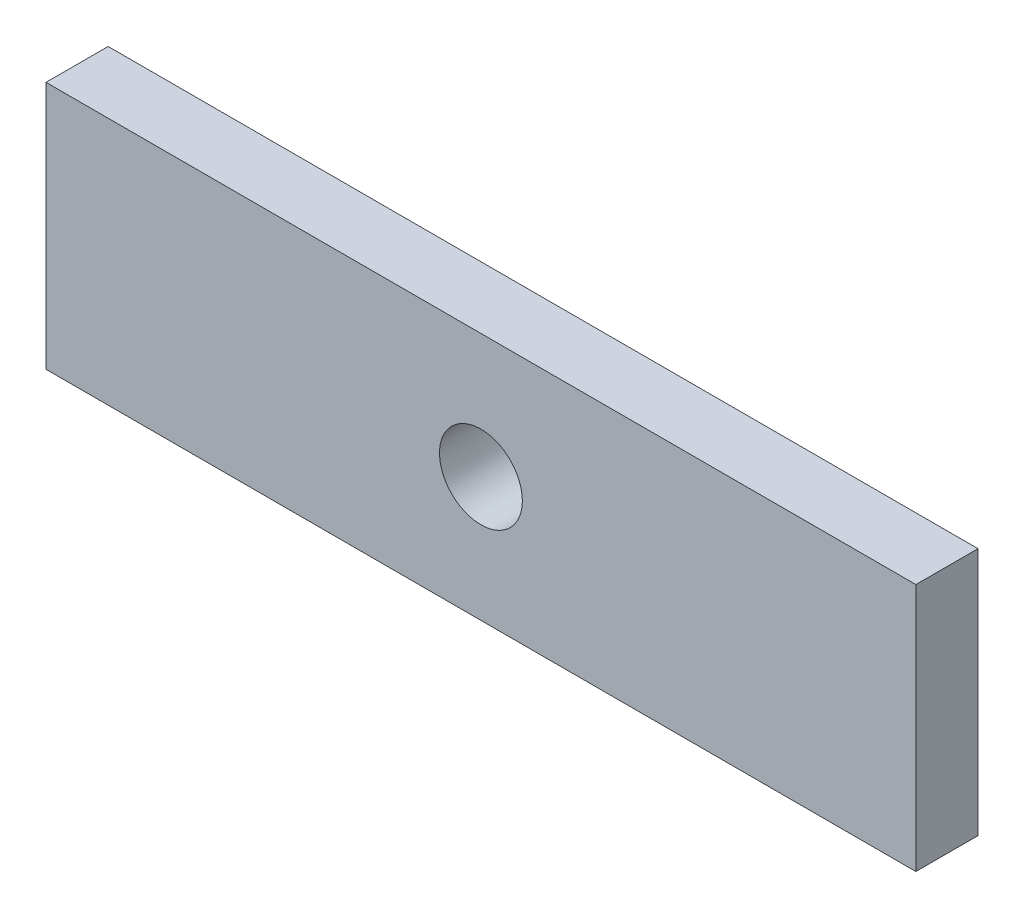
ISO-10303-21;
HEADER;
FILE_DESCRIPTION(('STEP AP214'),'2;1');
FILE_NAME('part.step','',(''),(''),'','','');
FILE_SCHEMA(('AUTOMOTIVE_DESIGN { 1 0 10303 214 1 1 1 1 }'));
ENDSEC;
DATA;
#1=APPLICATION_CONTEXT('core data for automotive mechanical design processes');
#2=APPLICATION_PROTOCOL_DEFINITION('international standard','automotive_design',2000,#1);
#3=PRODUCT_CONTEXT('',#1,'mechanical');
#4=PRODUCT('Part','Part','',(#3));
#5=PRODUCT_RELATED_PRODUCT_CATEGORY('part','',(#4));
#6=PRODUCT_DEFINITION_FORMATION('','',#4);
#7=PRODUCT_DEFINITION_CONTEXT('part definition',#1,'design');
#8=PRODUCT_DEFINITION('design','',#6,#7);
#9=PRODUCT_DEFINITION_SHAPE('','',#8);
#10=(LENGTH_UNIT() NAMED_UNIT(*) SI_UNIT(.MILLI.,.METRE.));
#11=(NAMED_UNIT(*) PLANE_ANGLE_UNIT() SI_UNIT($,.RADIAN.));
#12=(NAMED_UNIT(*) SI_UNIT($,.STERADIAN.) SOLID_ANGLE_UNIT());
#13=UNCERTAINTY_MEASURE_WITH_UNIT(LENGTH_MEASURE(1.E-05),#10,'distance_accuracy_value','');
#14=(GEOMETRIC_REPRESENTATION_CONTEXT(3) GLOBAL_UNCERTAINTY_ASSIGNED_CONTEXT((#13)) GLOBAL_UNIT_ASSIGNED_CONTEXT((#10,
#11,#12)) REPRESENTATION_CONTEXT('',''));
#15=CARTESIAN_POINT('',(0.,0.,0.));
#16=DIRECTION('',(0.,0.,1.));
#17=DIRECTION('',(1.,0.,0.));
#18=AXIS2_PLACEMENT_3D('',#15,#16,#17);
#19=CARTESIAN_POINT('',(0.,120.,30.));
#20=DIRECTION('',(0.,0.,-1.));
#21=DIRECTION('',(-1.,0.,0.));
#22=AXIS2_PLACEMENT_3D('',#19,#20,#21);
#23=PLANE('',#22);
#24=DIRECTION('',(0.,-1.,0.));
#25=VECTOR('',#24,1.);
#26=CARTESIAN_POINT('',(0.,0.,30.));
#27=LINE('',#26,#25);
#28=CARTESIAN_POINT('',(0.,120.,30.));
#29=VERTEX_POINT('',#28);
#30=CARTESIAN_POINT('',(0.,0.,30.));
#31=VERTEX_POINT('',#30);
#32=EDGE_CURVE('E86',#29,#31,#27,.T.);
#33=ORIENTED_EDGE('',*,*,#32,.T.);
#34=DIRECTION('',(1.,0.,0.));
#35=VECTOR('',#34,1.);
#36=CARTESIAN_POINT('',(0.,0.,30.));
#37=LINE('',#36,#35);
#38=CARTESIAN_POINT('',(420.,0.,30.));
#39=VERTEX_POINT('',#38);
#40=EDGE_CURVE('E81',#31,#39,#37,.T.);
#41=ORIENTED_EDGE('',*,*,#40,.T.);
#42=DIRECTION('',(0.,1.,0.));
#43=VECTOR('',#42,1.);
#44=CARTESIAN_POINT('',(420.,0.,30.));
#45=LINE('',#44,#43);
#46=CARTESIAN_POINT('',(420.,120.,30.));
#47=VERTEX_POINT('',#46);
#48=EDGE_CURVE('E84',#39,#47,#45,.T.);
#49=ORIENTED_EDGE('',*,*,#48,.T.);
#50=DIRECTION('',(-1.,0.,0.));
#51=VECTOR('',#50,1.);
#52=CARTESIAN_POINT('',(0.,120.,30.));
#53=LINE('',#52,#51);
#54=EDGE_CURVE('E51',#47,#29,#53,.T.);
#55=ORIENTED_EDGE('',*,*,#54,.T.);
#56=EDGE_LOOP('',(#33,#41,#49,#55));
#57=FACE_BOUND('',#56,.T.);
#58=CARTESIAN_POINT('',(210.,60.,30.));
#59=DIRECTION('',(0.,0.,1.));
#60=DIRECTION('',(1.,0.,0.));
#61=AXIS2_PLACEMENT_3D('',#58,#59,#60);
#62=CIRCLE('',#61,20.);
#63=CARTESIAN_POINT('',(230.,60.,30.));
#64=VERTEX_POINT('',#63);
#65=EDGE_CURVE('E101',#64,#64,#62,.T.);
#66=ORIENTED_EDGE('',*,*,#65,.F.);
#67=EDGE_LOOP('',(#66));
#68=FACE_BOUND('',#67,.T.);
#69=ADVANCED_FACE('F34',(#57,#68),#23,.F.);
#70=CARTESIAN_POINT('',(0.,120.,0.));
#71=DIRECTION('',(0.,0.,-1.));
#72=DIRECTION('',(-1.,0.,0.));
#73=AXIS2_PLACEMENT_3D('',#70,#71,#72);
#74=PLANE('',#73);
#75=DIRECTION('',(0.,-1.,0.));
#76=VECTOR('',#75,1.);
#77=CARTESIAN_POINT('',(0.,0.,0.));
#78=LINE('',#77,#76);
#79=CARTESIAN_POINT('',(0.,120.,0.));
#80=VERTEX_POINT('',#79);
#81=CARTESIAN_POINT('',(0.,0.,0.));
#82=VERTEX_POINT('',#81);
#83=EDGE_CURVE('E98',#80,#82,#78,.T.);
#84=ORIENTED_EDGE('',*,*,#83,.F.);
#85=DIRECTION('',(-1.,0.,0.));
#86=VECTOR('',#85,1.);
#87=CARTESIAN_POINT('',(0.,120.,0.));
#88=LINE('',#87,#86);
#89=CARTESIAN_POINT('',(420.,120.,0.));
#90=VERTEX_POINT('',#89);
#91=EDGE_CURVE('E74',#90,#80,#88,.T.);
#92=ORIENTED_EDGE('',*,*,#91,.F.);
#93=DIRECTION('',(0.,1.,0.));
#94=VECTOR('',#93,1.);
#95=CARTESIAN_POINT('',(420.,0.,0.));
#96=LINE('',#95,#94);
#97=CARTESIAN_POINT('',(420.,0.,0.));
#98=VERTEX_POINT('',#97);
#99=EDGE_CURVE('E68',#98,#90,#96,.T.);
#100=ORIENTED_EDGE('',*,*,#99,.F.);
#101=DIRECTION('',(1.,0.,0.));
#102=VECTOR('',#101,1.);
#103=CARTESIAN_POINT('',(0.,0.,0.));
#104=LINE('',#103,#102);
#105=EDGE_CURVE('E90',#82,#98,#104,.T.);
#106=ORIENTED_EDGE('',*,*,#105,.F.);
#107=EDGE_LOOP('',(#84,#92,#100,#106));
#108=FACE_BOUND('',#107,.T.);
#109=CARTESIAN_POINT('',(210.,60.,0.));
#110=DIRECTION('',(0.,0.,1.));
#111=DIRECTION('',(1.,0.,0.));
#112=AXIS2_PLACEMENT_3D('',#109,#110,#111);
#113=CIRCLE('',#112,20.);
#114=CARTESIAN_POINT('',(230.,60.,0.));
#115=VERTEX_POINT('',#114);
#116=EDGE_CURVE('E113',#115,#115,#113,.T.);
#117=ORIENTED_EDGE('',*,*,#116,.T.);
#118=EDGE_LOOP('',(#117));
#119=FACE_BOUND('',#118,.T.);
#120=ADVANCED_FACE('F109',(#108,#119),#74,.T.);
#121=CARTESIAN_POINT('',(0.,0.,30.));
#122=DIRECTION('',(1.,0.,0.));
#123=DIRECTION('',(0.,0.,-1.));
#124=AXIS2_PLACEMENT_3D('',#121,#122,#123);
#125=PLANE('',#124);
#126=ORIENTED_EDGE('',*,*,#83,.T.);
#127=DIRECTION('',(0.,0.,-1.));
#128=VECTOR('',#127,1.);
#129=CARTESIAN_POINT('',(0.,0.,30.));
#130=LINE('',#129,#128);
#131=EDGE_CURVE('E11',#31,#82,#130,.T.);
#132=ORIENTED_EDGE('',*,*,#131,.F.);
#133=ORIENTED_EDGE('',*,*,#32,.F.);
#134=DIRECTION('',(0.,0.,-1.));
#135=VECTOR('',#134,1.);
#136=CARTESIAN_POINT('',(0.,120.,30.));
#137=LINE('',#136,#135);
#138=EDGE_CURVE('E94',#29,#80,#137,.T.);
#139=ORIENTED_EDGE('',*,*,#138,.T.);
#140=EDGE_LOOP('',(#126,#132,#133,#139));
#141=FACE_BOUND('',#140,.T.);
#142=ADVANCED_FACE('F36',(#141),#125,.F.);
#143=CARTESIAN_POINT('',(0.,0.,30.));
#144=DIRECTION('',(0.,1.,0.));
#145=DIRECTION('',(0.,0.,1.));
#146=AXIS2_PLACEMENT_3D('',#143,#144,#145);
#147=PLANE('',#146);
#148=ORIENTED_EDGE('',*,*,#105,.T.);
#149=DIRECTION('',(0.,0.,-1.));
#150=VECTOR('',#149,1.);
#151=CARTESIAN_POINT('',(420.,0.,30.));
#152=LINE('',#151,#150);
#153=EDGE_CURVE('E43',#39,#98,#152,.T.);
#154=ORIENTED_EDGE('',*,*,#153,.F.);
#155=ORIENTED_EDGE('',*,*,#40,.F.);
#156=ORIENTED_EDGE('',*,*,#131,.T.);
#157=EDGE_LOOP('',(#148,#154,#155,#156));
#158=FACE_BOUND('',#157,.T.);
#159=ADVANCED_FACE('F89',(#158),#147,.F.);
#160=CARTESIAN_POINT('',(420.,0.,30.));
#161=DIRECTION('',(-1.,0.,0.));
#162=DIRECTION('',(0.,-1.,0.));
#163=AXIS2_PLACEMENT_3D('',#160,#161,#162);
#164=PLANE('',#163);
#165=ORIENTED_EDGE('',*,*,#99,.T.);
#166=DIRECTION('',(0.,0.,-1.));
#167=VECTOR('',#166,1.);
#168=CARTESIAN_POINT('',(420.,120.,30.));
#169=LINE('',#168,#167);
#170=EDGE_CURVE('E91',#47,#90,#169,.T.);
#171=ORIENTED_EDGE('',*,*,#170,.F.);
#172=ORIENTED_EDGE('',*,*,#48,.F.);
#173=ORIENTED_EDGE('',*,*,#153,.T.);
#174=EDGE_LOOP('',(#165,#171,#172,#173));
#175=FACE_BOUND('',#174,.T.);
#176=ADVANCED_FACE('F92',(#175),#164,.F.);
#177=CARTESIAN_POINT('',(0.,120.,30.));
#178=DIRECTION('',(0.,-1.,0.));
#179=DIRECTION('',(0.,0.,-1.));
#180=AXIS2_PLACEMENT_3D('',#177,#178,#179);
#181=PLANE('',#180);
#182=ORIENTED_EDGE('',*,*,#91,.T.);
#183=ORIENTED_EDGE('',*,*,#138,.F.);
#184=ORIENTED_EDGE('',*,*,#54,.F.);
#185=ORIENTED_EDGE('',*,*,#170,.T.);
#186=EDGE_LOOP('',(#182,#183,#184,#185));
#187=FACE_BOUND('',#186,.T.);
#188=ADVANCED_FACE('F106',(#187),#181,.F.);
#189=CARTESIAN_POINT('',(210.,60.,30.));
#190=DIRECTION('',(0.,0.,-1.));
#191=DIRECTION('',(-1.,0.,0.));
#192=AXIS2_PLACEMENT_3D('',#189,#190,#191);
#193=CYLINDRICAL_SURFACE('',#192,20.);
#194=ORIENTED_EDGE('',*,*,#65,.T.);
#195=EDGE_LOOP('',(#194));
#196=FACE_BOUND('',#195,.T.);
#197=ORIENTED_EDGE('',*,*,#116,.F.);
#198=EDGE_LOOP('',(#197));
#199=FACE_BOUND('',#198,.T.);
#200=ADVANCED_FACE('F119',(#196,#199),#193,.F.);
#201=CLOSED_SHELL('',(#69,#120,#142,#159,#176,#188,#200));
#202=MANIFOLD_SOLID_BREP('B2',#201);
#203=ADVANCED_BREP_SHAPE_REPRESENTATION('',(#18,#202),#14);
#204=SHAPE_DEFINITION_REPRESENTATION(#9,#203);
ENDSEC;
END-ISO-10303-21;
